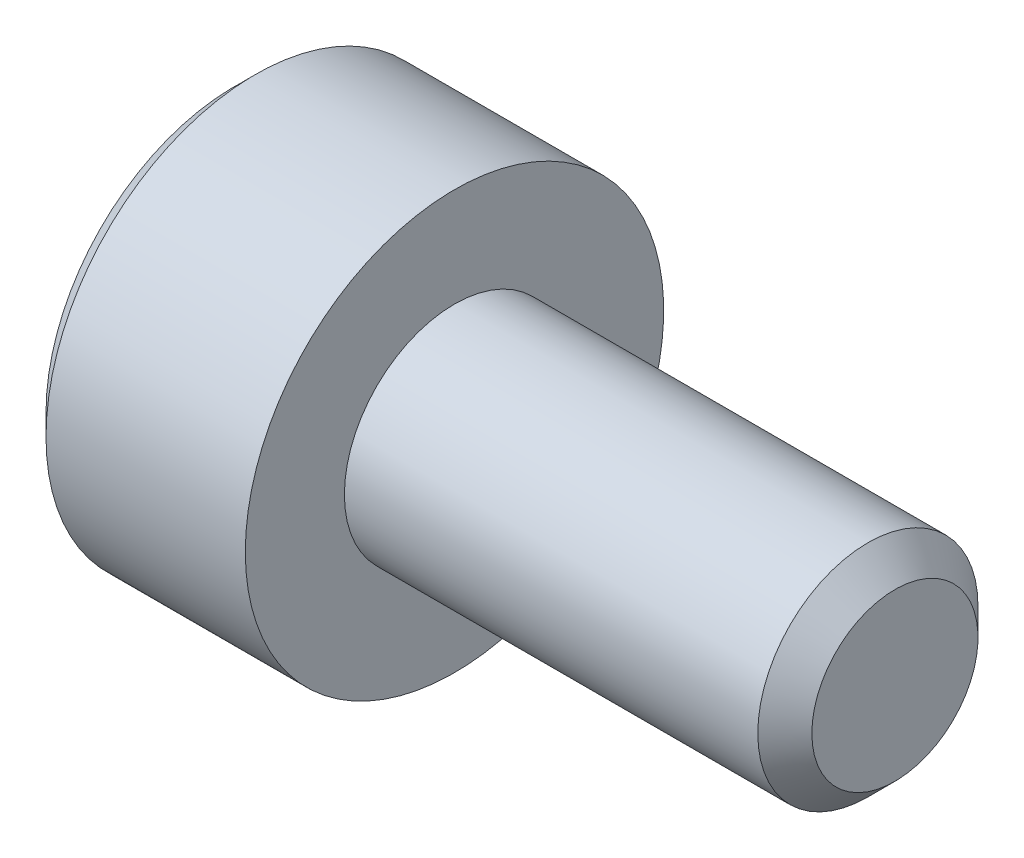
ISO-10303-21;
HEADER;
FILE_DESCRIPTION(('STEP AP214'),'2;1');
FILE_NAME('part.step','',(''),(''),'','','');
FILE_SCHEMA(('AUTOMOTIVE_DESIGN { 1 0 10303 214 1 1 1 1 }'));
ENDSEC;
DATA;
#1=APPLICATION_CONTEXT('core data for automotive mechanical design processes');
#2=APPLICATION_PROTOCOL_DEFINITION('international standard','automotive_design',2000,#1);
#3=PRODUCT_CONTEXT('',#1,'mechanical');
#4=PRODUCT('Part','Part','',(#3));
#5=PRODUCT_RELATED_PRODUCT_CATEGORY('part','',(#4));
#6=PRODUCT_DEFINITION_FORMATION('','',#4);
#7=PRODUCT_DEFINITION_CONTEXT('part definition',#1,'design');
#8=PRODUCT_DEFINITION('design','',#6,#7);
#9=PRODUCT_DEFINITION_SHAPE('','',#8);
#10=(LENGTH_UNIT() NAMED_UNIT(*) SI_UNIT(.MILLI.,.METRE.));
#11=(NAMED_UNIT(*) PLANE_ANGLE_UNIT() SI_UNIT($,.RADIAN.));
#12=(NAMED_UNIT(*) SI_UNIT($,.STERADIAN.) SOLID_ANGLE_UNIT());
#13=UNCERTAINTY_MEASURE_WITH_UNIT(LENGTH_MEASURE(1.E-05),#10,'distance_accuracy_value','');
#14=(GEOMETRIC_REPRESENTATION_CONTEXT(3) GLOBAL_UNCERTAINTY_ASSIGNED_CONTEXT((#13)) GLOBAL_UNIT_ASSIGNED_CONTEXT((#10,
#11,#12)) REPRESENTATION_CONTEXT('',''));
#15=CARTESIAN_POINT('',(0.,0.,0.));
#16=DIRECTION('',(0.,0.,1.));
#17=DIRECTION('',(1.,0.,0.));
#18=AXIS2_PLACEMENT_3D('',#15,#16,#17);
#19=CARTESIAN_POINT('',(-2.,0.,0.));
#20=DIRECTION('',(1.,0.,0.));
#21=DIRECTION('',(0.,0.,-1.));
#22=AXIS2_PLACEMENT_3D('',#19,#20,#21);
#23=PLANE('',#22);
#24=CARTESIAN_POINT('',(-2.,0.,0.));
#25=DIRECTION('',(-1.,0.,0.));
#26=DIRECTION('',(0.,0.,1.));
#27=AXIS2_PLACEMENT_3D('',#24,#25,#26);
#28=CIRCLE('',#27,1.71);
#29=CARTESIAN_POINT('',(-2.,0.,1.71));
#30=VERTEX_POINT('',#29);
#31=EDGE_CURVE('E11',#30,#30,#28,.T.);
#32=ORIENTED_EDGE('',*,*,#31,.T.);
#33=EDGE_LOOP('',(#32));
#34=FACE_BOUND('',#33,.T.);
#35=DIRECTION('',(0.,-1.,0.));
#36=VECTOR('',#35,1.);
#37=CARTESIAN_POINT('',(-2.,0.43301270189222,0.75));
#38=LINE('',#37,#36);
#39=CARTESIAN_POINT('',(-2.,0.43301270189222,0.75));
#40=VERTEX_POINT('',#39);
#41=CARTESIAN_POINT('',(-2.,-0.43301270189222,0.75));
#42=VERTEX_POINT('',#41);
#43=EDGE_CURVE('E53',#40,#42,#38,.T.);
#44=ORIENTED_EDGE('',*,*,#43,.T.);
#45=DIRECTION('',(0.,-0.500000000000001,-0.866025403784438));
#46=VECTOR('',#45,1.);
#47=CARTESIAN_POINT('',(-2.,-0.43301270189222,0.75));
#48=LINE('',#47,#46);
#49=CARTESIAN_POINT('',(-2.,-0.86602540378444,0.));
#50=VERTEX_POINT('',#49);
#51=EDGE_CURVE('E124',#42,#50,#48,.T.);
#52=ORIENTED_EDGE('',*,*,#51,.T.);
#53=DIRECTION('',(0.,0.500000000000001,-0.866025403784438));
#54=VECTOR('',#53,1.);
#55=CARTESIAN_POINT('',(-2.,-0.86602540378444,0.));
#56=LINE('',#55,#54);
#57=CARTESIAN_POINT('',(-2.,-0.43301270189222,-0.75));
#58=VERTEX_POINT('',#57);
#59=EDGE_CURVE('E127',#50,#58,#56,.T.);
#60=ORIENTED_EDGE('',*,*,#59,.T.);
#61=DIRECTION('',(0.,1.,0.));
#62=VECTOR('',#61,1.);
#63=CARTESIAN_POINT('',(-2.,-0.43301270189222,-0.75));
#64=LINE('',#63,#62);
#65=CARTESIAN_POINT('',(-2.,0.43301270189222,-0.75));
#66=VERTEX_POINT('',#65);
#67=EDGE_CURVE('E130',#58,#66,#64,.T.);
#68=ORIENTED_EDGE('',*,*,#67,.T.);
#69=DIRECTION('',(0.,0.500000000000001,0.866025403784438));
#70=VECTOR('',#69,1.);
#71=CARTESIAN_POINT('',(-2.,0.43301270189222,-0.75));
#72=LINE('',#71,#70);
#73=CARTESIAN_POINT('',(-2.,0.86602540378444,0.));
#74=VERTEX_POINT('',#73);
#75=EDGE_CURVE('E114',#66,#74,#72,.T.);
#76=ORIENTED_EDGE('',*,*,#75,.T.);
#77=DIRECTION('',(0.,-0.500000000000001,0.866025403784438));
#78=VECTOR('',#77,1.);
#79=CARTESIAN_POINT('',(-2.,0.86602540378444,0.));
#80=LINE('',#79,#78);
#81=EDGE_CURVE('E133',#74,#40,#80,.T.);
#82=ORIENTED_EDGE('',*,*,#81,.T.);
#83=EDGE_LOOP('',(#44,#52,#60,#68,#76,#82));
#84=FACE_BOUND('',#83,.T.);
#85=ADVANCED_FACE('F39',(#34,#84),#23,.F.);
#86=CARTESIAN_POINT('',(-1.81,0.,0.));
#87=DIRECTION('',(1.,0.,0.));
#88=DIRECTION('',(0.,0.,-1.));
#89=AXIS2_PLACEMENT_3D('',#86,#87,#88);
#90=CONICAL_SURFACE('',#89,1.9,0.785398163397448);
#91=ORIENTED_EDGE('',*,*,#31,.F.);
#92=EDGE_LOOP('',(#91));
#93=FACE_BOUND('',#92,.T.);
#94=CARTESIAN_POINT('',(-1.81,0.,0.));
#95=DIRECTION('',(-1.,0.,0.));
#96=DIRECTION('',(0.,0.,1.));
#97=AXIS2_PLACEMENT_3D('',#94,#95,#96);
#98=CIRCLE('',#97,1.9);
#99=CARTESIAN_POINT('',(-1.81,0.,1.9));
#100=VERTEX_POINT('',#99);
#101=EDGE_CURVE('E46',#100,#100,#98,.T.);
#102=ORIENTED_EDGE('',*,*,#101,.T.);
#103=EDGE_LOOP('',(#102));
#104=FACE_BOUND('',#103,.T.);
#105=ADVANCED_FACE('F158',(#93,#104),#90,.T.);
#106=CARTESIAN_POINT('',(4.,0.,0.));
#107=DIRECTION('',(-1.,0.,0.));
#108=DIRECTION('',(0.,0.,1.));
#109=AXIS2_PLACEMENT_3D('',#106,#107,#108);
#110=CYLINDRICAL_SURFACE('',#109,1.9);
#111=ORIENTED_EDGE('',*,*,#101,.F.);
#112=EDGE_LOOP('',(#111));
#113=FACE_BOUND('',#112,.T.);
#114=CARTESIAN_POINT('',(0.,0.,0.));
#115=DIRECTION('',(-1.,0.,0.));
#116=DIRECTION('',(0.,0.,1.));
#117=AXIS2_PLACEMENT_3D('',#114,#115,#116);
#118=CIRCLE('',#117,1.9);
#119=CARTESIAN_POINT('',(0.,0.,1.9));
#120=VERTEX_POINT('',#119);
#121=EDGE_CURVE('E153',#120,#120,#118,.T.);
#122=ORIENTED_EDGE('',*,*,#121,.T.);
#123=EDGE_LOOP('',(#122));
#124=FACE_BOUND('',#123,.T.);
#125=ADVANCED_FACE('F160',(#113,#124),#110,.T.);
#126=CARTESIAN_POINT('',(0.,1.9,0.));
#127=DIRECTION('',(-1.,0.,0.));
#128=DIRECTION('',(0.,0.,1.));
#129=AXIS2_PLACEMENT_3D('',#126,#127,#128);
#130=PLANE('',#129);
#131=ORIENTED_EDGE('',*,*,#121,.F.);
#132=EDGE_LOOP('',(#131));
#133=FACE_BOUND('',#132,.T.);
#134=CARTESIAN_POINT('',(0.,0.,0.));
#135=DIRECTION('',(-1.,0.,0.));
#136=DIRECTION('',(0.,0.,1.));
#137=AXIS2_PLACEMENT_3D('',#134,#135,#136);
#138=CIRCLE('',#137,1.);
#139=CARTESIAN_POINT('',(0.,0.,1.));
#140=VERTEX_POINT('',#139);
#141=EDGE_CURVE('E150',#140,#140,#138,.T.);
#142=ORIENTED_EDGE('',*,*,#141,.T.);
#143=EDGE_LOOP('',(#142));
#144=FACE_BOUND('',#143,.T.);
#145=ADVANCED_FACE('F163',(#133,#144),#130,.F.);
#146=CARTESIAN_POINT('',(4.,0.,0.));
#147=DIRECTION('',(-1.,0.,0.));
#148=DIRECTION('',(0.,0.,1.));
#149=AXIS2_PLACEMENT_3D('',#146,#147,#148);
#150=CYLINDRICAL_SURFACE('',#149,1.);
#151=ORIENTED_EDGE('',*,*,#141,.F.);
#152=EDGE_LOOP('',(#151));
#153=FACE_BOUND('',#152,.T.);
#154=CARTESIAN_POINT('',(3.7545,0.,0.));
#155=DIRECTION('',(-1.,0.,0.));
#156=DIRECTION('',(0.,0.,1.));
#157=AXIS2_PLACEMENT_3D('',#154,#155,#156);
#158=CIRCLE('',#157,1.);
#159=CARTESIAN_POINT('',(3.7545,0.,1.));
#160=VERTEX_POINT('',#159);
#161=EDGE_CURVE('E147',#160,#160,#158,.T.);
#162=ORIENTED_EDGE('',*,*,#161,.T.);
#163=EDGE_LOOP('',(#162));
#164=FACE_BOUND('',#163,.T.);
#165=ADVANCED_FACE('F169',(#153,#164),#150,.T.);
#166=CARTESIAN_POINT('',(4.,0.,0.));
#167=DIRECTION('',(-1.,0.,0.));
#168=DIRECTION('',(0.,0.,1.));
#169=AXIS2_PLACEMENT_3D('',#166,#167,#168);
#170=CONICAL_SURFACE('',#169,0.754500000000001,0.785398163397447);
#171=ORIENTED_EDGE('',*,*,#161,.F.);
#172=EDGE_LOOP('',(#171));
#173=FACE_BOUND('',#172,.T.);
#174=CARTESIAN_POINT('',(4.,0.,0.));
#175=DIRECTION('',(-1.,0.,0.));
#176=DIRECTION('',(0.,0.,1.));
#177=AXIS2_PLACEMENT_3D('',#174,#175,#176);
#178=CIRCLE('',#177,0.754500000000001);
#179=CARTESIAN_POINT('',(4.,0.,0.754500000000001));
#180=VERTEX_POINT('',#179);
#181=EDGE_CURVE('E144',#180,#180,#178,.T.);
#182=ORIENTED_EDGE('',*,*,#181,.T.);
#183=EDGE_LOOP('',(#182));
#184=FACE_BOUND('',#183,.T.);
#185=ADVANCED_FACE('F175',(#173,#184),#170,.T.);
#186=CARTESIAN_POINT('',(4.,0.754500000000001,0.));
#187=DIRECTION('',(-1.,0.,0.));
#188=DIRECTION('',(0.,0.,1.));
#189=AXIS2_PLACEMENT_3D('',#186,#187,#188);
#190=PLANE('',#189);
#191=ORIENTED_EDGE('',*,*,#181,.F.);
#192=EDGE_LOOP('',(#191));
#193=FACE_BOUND('',#192,.T.);
#194=ADVANCED_FACE('F181',(#193),#190,.F.);
#195=CARTESIAN_POINT('',(-1.2,0.43301270189222,0.75));
#196=DIRECTION('',(0.,0.,-1.));
#197=DIRECTION('',(-1.,0.,0.));
#198=AXIS2_PLACEMENT_3D('',#195,#196,#197);
#199=PLANE('',#198);
#200=ORIENTED_EDGE('',*,*,#43,.F.);
#201=DIRECTION('',(-1.,0.,0.));
#202=VECTOR('',#201,1.);
#203=CARTESIAN_POINT('',(-1.2,0.43301270189222,0.75));
#204=LINE('',#203,#202);
#205=CARTESIAN_POINT('',(-1.2,0.43301270189222,0.75));
#206=VERTEX_POINT('',#205);
#207=EDGE_CURVE('E119',#206,#40,#204,.T.);
#208=ORIENTED_EDGE('',*,*,#207,.F.);
#209=DIRECTION('',(0.,-1.,0.));
#210=VECTOR('',#209,1.);
#211=CARTESIAN_POINT('',(-1.2,0.43301270189222,0.75));
#212=LINE('',#211,#210);
#213=CARTESIAN_POINT('',(-1.2,-0.43301270189222,0.75));
#214=VERTEX_POINT('',#213);
#215=EDGE_CURVE('E136',#206,#214,#212,.T.);
#216=ORIENTED_EDGE('',*,*,#215,.T.);
#217=DIRECTION('',(-1.,0.,0.));
#218=VECTOR('',#217,1.);
#219=CARTESIAN_POINT('',(-1.2,-0.43301270189222,0.75));
#220=LINE('',#219,#218);
#221=EDGE_CURVE('E142',#214,#42,#220,.T.);
#222=ORIENTED_EDGE('',*,*,#221,.T.);
#223=EDGE_LOOP('',(#200,#208,#216,#222));
#224=FACE_BOUND('',#223,.T.);
#225=ADVANCED_FACE('F186',(#224),#199,.T.);
#226=CARTESIAN_POINT('',(-1.2,-0.43301270189222,0.75));
#227=DIRECTION('',(0.,0.866025403784438,-0.500000000000001));
#228=DIRECTION('',(0.,0.500000000000001,0.866025403784438));
#229=AXIS2_PLACEMENT_3D('',#226,#227,#228);
#230=PLANE('',#229);
#231=ORIENTED_EDGE('',*,*,#51,.F.);
#232=ORIENTED_EDGE('',*,*,#221,.F.);
#233=DIRECTION('',(0.,-0.500000000000001,-0.866025403784438));
#234=VECTOR('',#233,1.);
#235=CARTESIAN_POINT('',(-1.2,-0.43301270189222,0.75));
#236=LINE('',#235,#234);
#237=CARTESIAN_POINT('',(-1.2,-0.86602540378444,0.));
#238=VERTEX_POINT('',#237);
#239=EDGE_CURVE('E92',#214,#238,#236,.T.);
#240=ORIENTED_EDGE('',*,*,#239,.T.);
#241=DIRECTION('',(-1.,0.,0.));
#242=VECTOR('',#241,1.);
#243=CARTESIAN_POINT('',(-1.2,-0.86602540378444,0.));
#244=LINE('',#243,#242);
#245=EDGE_CURVE('E140',#238,#50,#244,.T.);
#246=ORIENTED_EDGE('',*,*,#245,.T.);
#247=EDGE_LOOP('',(#231,#232,#240,#246));
#248=FACE_BOUND('',#247,.T.);
#249=ADVANCED_FACE('F191',(#248),#230,.T.);
#250=CARTESIAN_POINT('',(-1.2,-0.86602540378444,0.));
#251=DIRECTION('',(0.,0.866025403784438,0.500000000000001));
#252=DIRECTION('',(0.,-0.500000000000001,0.866025403784438));
#253=AXIS2_PLACEMENT_3D('',#250,#251,#252);
#254=PLANE('',#253);
#255=ORIENTED_EDGE('',*,*,#59,.F.);
#256=ORIENTED_EDGE('',*,*,#245,.F.);
#257=DIRECTION('',(0.,0.500000000000001,-0.866025403784438));
#258=VECTOR('',#257,1.);
#259=CARTESIAN_POINT('',(-1.2,-0.86602540378444,0.));
#260=LINE('',#259,#258);
#261=CARTESIAN_POINT('',(-1.2,-0.43301270189222,-0.75));
#262=VERTEX_POINT('',#261);
#263=EDGE_CURVE('E110',#238,#262,#260,.T.);
#264=ORIENTED_EDGE('',*,*,#263,.T.);
#265=DIRECTION('',(-1.,0.,0.));
#266=VECTOR('',#265,1.);
#267=CARTESIAN_POINT('',(-1.2,-0.43301270189222,-0.75));
#268=LINE('',#267,#266);
#269=EDGE_CURVE('E107',#262,#58,#268,.T.);
#270=ORIENTED_EDGE('',*,*,#269,.T.);
#271=EDGE_LOOP('',(#255,#256,#264,#270));
#272=FACE_BOUND('',#271,.T.);
#273=ADVANCED_FACE('F208',(#272),#254,.T.);
#274=CARTESIAN_POINT('',(-1.2,-0.43301270189222,-0.75));
#275=DIRECTION('',(0.,0.,1.));
#276=DIRECTION('',(1.,0.,0.));
#277=AXIS2_PLACEMENT_3D('',#274,#275,#276);
#278=PLANE('',#277);
#279=ORIENTED_EDGE('',*,*,#67,.F.);
#280=ORIENTED_EDGE('',*,*,#269,.F.);
#281=DIRECTION('',(0.,1.,0.));
#282=VECTOR('',#281,1.);
#283=CARTESIAN_POINT('',(-1.2,-0.43301270189222,-0.75));
#284=LINE('',#283,#282);
#285=CARTESIAN_POINT('',(-1.2,0.43301270189222,-0.75));
#286=VERTEX_POINT('',#285);
#287=EDGE_CURVE('E102',#262,#286,#284,.T.);
#288=ORIENTED_EDGE('',*,*,#287,.T.);
#289=DIRECTION('',(-1.,0.,0.));
#290=VECTOR('',#289,1.);
#291=CARTESIAN_POINT('',(-1.2,0.43301270189222,-0.75));
#292=LINE('',#291,#290);
#293=EDGE_CURVE('E106',#286,#66,#292,.T.);
#294=ORIENTED_EDGE('',*,*,#293,.T.);
#295=EDGE_LOOP('',(#279,#280,#288,#294));
#296=FACE_BOUND('',#295,.T.);
#297=ADVANCED_FACE('F105',(#296),#278,.T.);
#298=CARTESIAN_POINT('',(-1.2,0.43301270189222,-0.75));
#299=DIRECTION('',(0.,-0.866025403784438,0.500000000000001));
#300=DIRECTION('',(0.,-0.500000000000001,-0.866025403784438));
#301=AXIS2_PLACEMENT_3D('',#298,#299,#300);
#302=PLANE('',#301);
#303=ORIENTED_EDGE('',*,*,#75,.F.);
#304=ORIENTED_EDGE('',*,*,#293,.F.);
#305=DIRECTION('',(0.,0.500000000000001,0.866025403784438));
#306=VECTOR('',#305,1.);
#307=CARTESIAN_POINT('',(-1.2,0.43301270189222,-0.75));
#308=LINE('',#307,#306);
#309=CARTESIAN_POINT('',(-1.2,0.86602540378444,0.));
#310=VERTEX_POINT('',#309);
#311=EDGE_CURVE('E109',#286,#310,#308,.T.);
#312=ORIENTED_EDGE('',*,*,#311,.T.);
#313=DIRECTION('',(-1.,0.,0.));
#314=VECTOR('',#313,1.);
#315=CARTESIAN_POINT('',(-1.2,0.86602540378444,0.));
#316=LINE('',#315,#314);
#317=EDGE_CURVE('E83',#310,#74,#316,.T.);
#318=ORIENTED_EDGE('',*,*,#317,.T.);
#319=EDGE_LOOP('',(#303,#304,#312,#318));
#320=FACE_BOUND('',#319,.T.);
#321=ADVANCED_FACE('F112',(#320),#302,.T.);
#322=CARTESIAN_POINT('',(-1.2,0.86602540378444,0.));
#323=DIRECTION('',(0.,-0.866025403784438,-0.500000000000001));
#324=DIRECTION('',(0.,0.500000000000001,-0.866025403784438));
#325=AXIS2_PLACEMENT_3D('',#322,#323,#324);
#326=PLANE('',#325);
#327=ORIENTED_EDGE('',*,*,#81,.F.);
#328=ORIENTED_EDGE('',*,*,#317,.F.);
#329=DIRECTION('',(0.,-0.500000000000001,0.866025403784438));
#330=VECTOR('',#329,1.);
#331=CARTESIAN_POINT('',(-1.2,0.86602540378444,0.));
#332=LINE('',#331,#330);
#333=EDGE_CURVE('E61',#310,#206,#332,.T.);
#334=ORIENTED_EDGE('',*,*,#333,.T.);
#335=ORIENTED_EDGE('',*,*,#207,.T.);
#336=EDGE_LOOP('',(#327,#328,#334,#335));
#337=FACE_BOUND('',#336,.T.);
#338=ADVANCED_FACE('F201',(#337),#326,.T.);
#339=CARTESIAN_POINT('',(-1.2,0.,0.));
#340=DIRECTION('',(1.,0.,0.));
#341=DIRECTION('',(0.,0.,-1.));
#342=AXIS2_PLACEMENT_3D('',#339,#340,#341);
#343=PLANE('',#342);
#344=ORIENTED_EDGE('',*,*,#215,.F.);
#345=ORIENTED_EDGE('',*,*,#333,.F.);
#346=ORIENTED_EDGE('',*,*,#311,.F.);
#347=ORIENTED_EDGE('',*,*,#287,.F.);
#348=ORIENTED_EDGE('',*,*,#263,.F.);
#349=ORIENTED_EDGE('',*,*,#239,.F.);
#350=EDGE_LOOP('',(#344,#345,#346,#347,#348,#349));
#351=FACE_BOUND('',#350,.T.);
#352=ADVANCED_FACE('F117',(#351),#343,.F.);
#353=CLOSED_SHELL('',(#85,#105,#125,#145,#165,#185,#194,#225,#249,#273,#297,#321,#338,#352));
#354=MANIFOLD_SOLID_BREP('B2',#353);
#355=ADVANCED_BREP_SHAPE_REPRESENTATION('',(#18,#354),#14);
#356=SHAPE_DEFINITION_REPRESENTATION(#9,#355);
ENDSEC;
END-ISO-10303-21;
